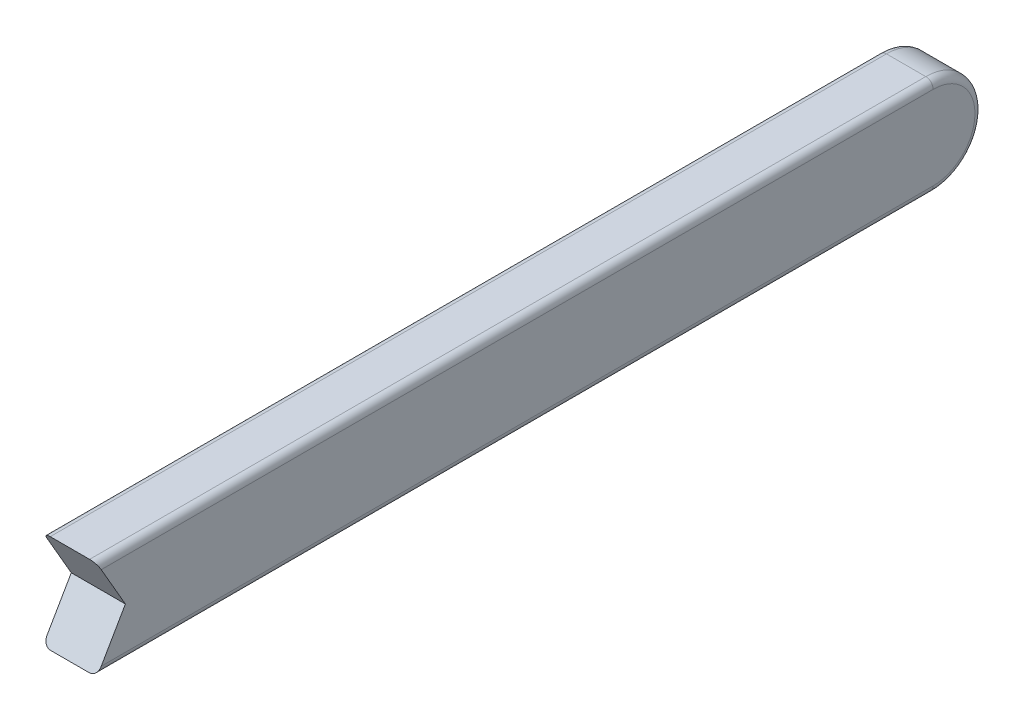
ISO-10303-21;
HEADER;
FILE_DESCRIPTION(('STEP AP214'),'2;1');
FILE_NAME('part.step','',(''),(''),'','','');
FILE_SCHEMA(('AUTOMOTIVE_DESIGN { 1 0 10303 214 1 1 1 1 }'));
ENDSEC;
DATA;
#1=APPLICATION_CONTEXT('core data for automotive mechanical design processes');
#2=APPLICATION_PROTOCOL_DEFINITION('international standard','automotive_design',2000,#1);
#3=PRODUCT_CONTEXT('',#1,'mechanical');
#4=PRODUCT('Part','Part','',(#3));
#5=PRODUCT_RELATED_PRODUCT_CATEGORY('part','',(#4));
#6=PRODUCT_DEFINITION_FORMATION('','',#4);
#7=PRODUCT_DEFINITION_CONTEXT('part definition',#1,'design');
#8=PRODUCT_DEFINITION('design','',#6,#7);
#9=PRODUCT_DEFINITION_SHAPE('','',#8);
#10=(LENGTH_UNIT() NAMED_UNIT(*) SI_UNIT(.MILLI.,.METRE.));
#11=(NAMED_UNIT(*) PLANE_ANGLE_UNIT() SI_UNIT($,.RADIAN.));
#12=(NAMED_UNIT(*) SI_UNIT($,.STERADIAN.) SOLID_ANGLE_UNIT());
#13=UNCERTAINTY_MEASURE_WITH_UNIT(LENGTH_MEASURE(1.E-05),#10,'distance_accuracy_value','');
#14=(GEOMETRIC_REPRESENTATION_CONTEXT(3) GLOBAL_UNCERTAINTY_ASSIGNED_CONTEXT((#13)) GLOBAL_UNIT_ASSIGNED_CONTEXT((#10,
#11,#12)) REPRESENTATION_CONTEXT('',''));
#15=CARTESIAN_POINT('',(0.,0.,0.));
#16=DIRECTION('',(0.,0.,1.));
#17=DIRECTION('',(1.,0.,0.));
#18=AXIS2_PLACEMENT_3D('',#15,#16,#17);
#19=CARTESIAN_POINT('',(5.5,0.,-87.8867513459482));
#20=DIRECTION('',(-1.,0.,0.));
#21=DIRECTION('',(0.,0.,1.));
#22=AXIS2_PLACEMENT_3D('',#19,#20,#21);
#23=CYLINDRICAL_SURFACE('',#22,4.99999999999998);
#24=DIRECTION('',(-1.,0.,0.));
#25=VECTOR('',#24,1.);
#26=CARTESIAN_POINT('',(5.5,-4.99999999999999,-87.8867513459482));
#27=LINE('',#26,#25);
#28=CARTESIAN_POINT('',(0.75,-4.99999999999999,-87.8867513459482));
#29=VERTEX_POINT('',#28);
#30=CARTESIAN_POINT('',(4.75,-4.99999999999999,-87.8867513459482));
#31=VERTEX_POINT('',#30);
#32=EDGE_CURVE('E143',#29,#31,#27,.F.);
#33=ORIENTED_EDGE('',*,*,#32,.F.);
#34=CARTESIAN_POINT('',(0.75,0.,-87.8867513459482));
#35=DIRECTION('',(1.,0.,0.));
#36=DIRECTION('',(0.,0.,-1.));
#37=AXIS2_PLACEMENT_3D('',#34,#35,#36);
#38=CIRCLE('',#37,4.99999999999998);
#39=CARTESIAN_POINT('',(0.75,5.,-87.8867513459482));
#40=VERTEX_POINT('',#39);
#41=EDGE_CURVE('E155',#29,#40,#38,.T.);
#42=ORIENTED_EDGE('',*,*,#41,.T.);
#43=DIRECTION('',(-1.,0.,0.));
#44=VECTOR('',#43,1.);
#45=CARTESIAN_POINT('',(5.5,5.,-87.8867513459482));
#46=LINE('',#45,#44);
#47=CARTESIAN_POINT('',(4.75,5.,-87.8867513459482));
#48=VERTEX_POINT('',#47);
#49=EDGE_CURVE('E141',#48,#40,#46,.T.);
#50=ORIENTED_EDGE('',*,*,#49,.F.);
#51=CARTESIAN_POINT('',(4.75,0.,-87.8867513459482));
#52=DIRECTION('',(1.,0.,0.));
#53=DIRECTION('',(0.,0.,-1.));
#54=AXIS2_PLACEMENT_3D('',#51,#52,#53);
#55=CIRCLE('',#54,4.99999999999998);
#56=EDGE_CURVE('E153',#48,#31,#55,.F.);
#57=ORIENTED_EDGE('',*,*,#56,.T.);
#58=EDGE_LOOP('',(#33,#42,#50,#57));
#59=FACE_BOUND('',#58,.T.);
#60=ADVANCED_FACE('F35',(#59),#23,.T.);
#61=CARTESIAN_POINT('',(5.5,-4.99999999999995,0.));
#62=DIRECTION('',(0.,-1.,0.));
#63=DIRECTION('',(0.,0.,-1.));
#64=AXIS2_PLACEMENT_3D('',#61,#62,#63);
#65=PLANE('',#64);
#66=DIRECTION('',(-1.,0.,0.));
#67=VECTOR('',#66,1.);
#68=CARTESIAN_POINT('',(5.5,-4.99999999999995,-2.88675134594818));
#69=LINE('',#68,#67);
#70=CARTESIAN_POINT('',(4.75,-4.99999999999995,-2.88675134594818));
#71=VERTEX_POINT('',#70);
#72=CARTESIAN_POINT('',(0.75,-4.99999999999995,-2.88675134594818));
#73=VERTEX_POINT('',#72);
#74=EDGE_CURVE('E120',#71,#73,#69,.T.);
#75=ORIENTED_EDGE('',*,*,#74,.T.);
#76=DIRECTION('',(0.,0.,1.));
#77=VECTOR('',#76,1.);
#78=CARTESIAN_POINT('',(0.75,-4.99999999999999,-87.8867513459481));
#79=LINE('',#78,#77);
#80=EDGE_CURVE('E167',#73,#29,#79,.F.);
#81=ORIENTED_EDGE('',*,*,#80,.T.);
#82=ORIENTED_EDGE('',*,*,#32,.T.);
#83=DIRECTION('',(0.,0.,1.));
#84=VECTOR('',#83,1.);
#85=CARTESIAN_POINT('',(4.75,-4.99999999999995,0.));
#86=LINE('',#85,#84);
#87=EDGE_CURVE('E165',#31,#71,#86,.T.);
#88=ORIENTED_EDGE('',*,*,#87,.T.);
#89=EDGE_LOOP('',(#75,#81,#82,#88));
#90=FACE_BOUND('',#89,.T.);
#91=ADVANCED_FACE('F187',(#90),#65,.T.);
#92=CARTESIAN_POINT('',(5.5,4.99999999999999,0.));
#93=DIRECTION('',(0.,1.,0.));
#94=DIRECTION('',(0.,0.,1.));
#95=AXIS2_PLACEMENT_3D('',#92,#93,#94);
#96=PLANE('',#95);
#97=ORIENTED_EDGE('',*,*,#49,.T.);
#98=DIRECTION('',(0.,0.,-1.));
#99=VECTOR('',#98,1.);
#100=CARTESIAN_POINT('',(0.75,4.99999999999999,-2.88675134594811));
#101=LINE('',#100,#99);
#102=CARTESIAN_POINT('',(0.75,4.99999999999999,-2.88675134594811));
#103=VERTEX_POINT('',#102);
#104=EDGE_CURVE('E52',#40,#103,#101,.F.);
#105=ORIENTED_EDGE('',*,*,#104,.T.);
#106=DIRECTION('',(-1.,0.,0.));
#107=VECTOR('',#106,1.);
#108=CARTESIAN_POINT('',(5.5,4.99999999999999,-2.88675134594811));
#109=LINE('',#108,#107);
#110=CARTESIAN_POINT('',(4.75,4.99999999999999,-2.88675134594811));
#111=VERTEX_POINT('',#110);
#112=EDGE_CURVE('E126',#111,#103,#109,.T.);
#113=ORIENTED_EDGE('',*,*,#112,.F.);
#114=DIRECTION('',(0.,0.,-1.));
#115=VECTOR('',#114,1.);
#116=CARTESIAN_POINT('',(4.75,4.99999999999999,0.));
#117=LINE('',#116,#115);
#118=EDGE_CURVE('E169',#111,#48,#117,.T.);
#119=ORIENTED_EDGE('',*,*,#118,.T.);
#120=EDGE_LOOP('',(#97,#105,#113,#119));
#121=FACE_BOUND('',#120,.T.);
#122=ADVANCED_FACE('F222',(#121),#96,.T.);
#123=CARTESIAN_POINT('',(5.5,2.5,-4.33012701892217));
#124=DIRECTION('',(0.,-0.500000000000001,0.866025403784438));
#125=DIRECTION('',(0.,-0.866025403784438,-0.500000000000001));
#126=AXIS2_PLACEMENT_3D('',#123,#124,#125);
#127=PLANE('',#126);
#128=ORIENTED_EDGE('',*,*,#112,.T.);
#129=CARTESIAN_POINT('',(0.75,4.24999999999999,-3.31976404784033));
#130=DIRECTION('',(0.,-0.500000000000001,0.866025403784438));
#131=DIRECTION('',(0.,0.866025403784438,0.500000000000001));
#132=AXIS2_PLACEMENT_3D('',#129,#130,#131);
#133=ELLIPSE('',#132,0.866025403784439,0.75);
#134=CARTESIAN_POINT('',(0.,4.24999999999999,-3.31976404784033));
#135=VERTEX_POINT('',#134);
#136=EDGE_CURVE('E11',#103,#135,#133,.T.);
#137=ORIENTED_EDGE('',*,*,#136,.T.);
#138=DIRECTION('',(0.,0.866025403784438,0.500000000000001));
#139=VECTOR('',#138,1.);
#140=CARTESIAN_POINT('',(0.,2.5,-4.33012701892217));
#141=LINE('',#140,#139);
#142=CARTESIAN_POINT('',(0.,0.,-5.77350269189624));
#143=VERTEX_POINT('',#142);
#144=EDGE_CURVE('E125',#143,#135,#141,.T.);
#145=ORIENTED_EDGE('',*,*,#144,.F.);
#146=DIRECTION('',(-1.,0.,0.));
#147=VECTOR('',#146,1.);
#148=CARTESIAN_POINT('',(5.5,0.,-5.77350269189624));
#149=LINE('',#148,#147);
#150=CARTESIAN_POINT('',(5.5,0.,-5.77350269189624));
#151=VERTEX_POINT('',#150);
#152=EDGE_CURVE('E112',#151,#143,#149,.T.);
#153=ORIENTED_EDGE('',*,*,#152,.F.);
#154=DIRECTION('',(0.,0.866025403784438,0.500000000000001));
#155=VECTOR('',#154,1.);
#156=CARTESIAN_POINT('',(5.5,2.5,-4.33012701892217));
#157=LINE('',#156,#155);
#158=CARTESIAN_POINT('',(5.5,4.24999999999999,-3.31976404784033));
#159=VERTEX_POINT('',#158);
#160=EDGE_CURVE('E121',#151,#159,#157,.T.);
#161=ORIENTED_EDGE('',*,*,#160,.T.);
#162=CARTESIAN_POINT('',(4.75,4.24999999999999,-3.31976404784033));
#163=DIRECTION('',(0.,-0.500000000000001,0.866025403784438));
#164=DIRECTION('',(0.,-0.866025403784438,-0.500000000000001));
#165=AXIS2_PLACEMENT_3D('',#162,#163,#164);
#166=ELLIPSE('',#165,0.866025403784439,0.75);
#167=EDGE_CURVE('E44',#159,#111,#166,.T.);
#168=ORIENTED_EDGE('',*,*,#167,.T.);
#169=EDGE_LOOP('',(#128,#137,#145,#153,#161,#168));
#170=FACE_BOUND('',#169,.T.);
#171=ADVANCED_FACE('F123',(#170),#127,.T.);
#172=CARTESIAN_POINT('',(5.5,-2.49999999999998,-4.33012701892221));
#173=DIRECTION('',(0.,0.499999999999995,0.866025403784442));
#174=DIRECTION('',(0.,-0.866025403784441,0.499999999999995));
#175=AXIS2_PLACEMENT_3D('',#172,#173,#174);
#176=PLANE('',#175);
#177=DIRECTION('',(0.,0.866025403784442,-0.499999999999995));
#178=VECTOR('',#177,1.);
#179=CARTESIAN_POINT('',(0.,-2.49999999999998,-4.33012701892221));
#180=LINE('',#179,#178);
#181=CARTESIAN_POINT('',(0.,-4.24999999999995,-3.31976404784039));
#182=VERTEX_POINT('',#181);
#183=EDGE_CURVE('E132',#182,#143,#180,.T.);
#184=ORIENTED_EDGE('',*,*,#183,.F.);
#185=CARTESIAN_POINT('',(0.75,-4.24999999999995,-3.31976404784039));
#186=DIRECTION('',(0.,0.499999999999995,0.866025403784442));
#187=DIRECTION('',(0.,0.866025403784441,-0.499999999999995));
#188=AXIS2_PLACEMENT_3D('',#185,#186,#187);
#189=ELLIPSE('',#188,0.866025403784435,0.75);
#190=EDGE_CURVE('E163',#182,#73,#189,.T.);
#191=ORIENTED_EDGE('',*,*,#190,.T.);
#192=ORIENTED_EDGE('',*,*,#74,.F.);
#193=CARTESIAN_POINT('',(4.75,-4.24999999999995,-3.31976404784039));
#194=DIRECTION('',(0.,0.499999999999995,0.866025403784442));
#195=DIRECTION('',(0.,-0.866025403784441,0.499999999999995));
#196=AXIS2_PLACEMENT_3D('',#193,#194,#195);
#197=ELLIPSE('',#196,0.866025403784435,0.75);
#198=CARTESIAN_POINT('',(5.5,-4.24999999999995,-3.31976404784039));
#199=VERTEX_POINT('',#198);
#200=EDGE_CURVE('E116',#71,#199,#197,.T.);
#201=ORIENTED_EDGE('',*,*,#200,.T.);
#202=DIRECTION('',(0.,0.866025403784442,-0.499999999999995));
#203=VECTOR('',#202,1.);
#204=CARTESIAN_POINT('',(5.5,-2.49999999999998,-4.33012701892221));
#205=LINE('',#204,#203);
#206=EDGE_CURVE('E108',#199,#151,#205,.T.);
#207=ORIENTED_EDGE('',*,*,#206,.T.);
#208=ORIENTED_EDGE('',*,*,#152,.T.);
#209=EDGE_LOOP('',(#184,#191,#192,#201,#207,#208));
#210=FACE_BOUND('',#209,.T.);
#211=ADVANCED_FACE('F111',(#210),#176,.T.);
#212=CARTESIAN_POINT('',(5.5,0.,0.));
#213=DIRECTION('',(1.,0.,0.));
#214=DIRECTION('',(0.,0.,-1.));
#215=AXIS2_PLACEMENT_3D('',#212,#213,#214);
#216=PLANE('',#215);
#217=ORIENTED_EDGE('',*,*,#206,.F.);
#218=DIRECTION('',(0.,0.,1.));
#219=VECTOR('',#218,1.);
#220=CARTESIAN_POINT('',(5.5,-4.24999999999995,0.));
#221=LINE('',#220,#219);
#222=CARTESIAN_POINT('',(5.5,-4.24999999999998,-87.8867513459482));
#223=VERTEX_POINT('',#222);
#224=EDGE_CURVE('E160',#199,#223,#221,.F.);
#225=ORIENTED_EDGE('',*,*,#224,.T.);
#226=CARTESIAN_POINT('',(5.5,0.,-87.8867513459482));
#227=DIRECTION('',(1.,0.,0.));
#228=DIRECTION('',(0.,0.,-1.));
#229=AXIS2_PLACEMENT_3D('',#226,#227,#228);
#230=CIRCLE('',#229,4.24999999999998);
#231=CARTESIAN_POINT('',(5.5,4.25,-87.8867513459482));
#232=VERTEX_POINT('',#231);
#233=EDGE_CURVE('E158',#223,#232,#230,.T.);
#234=ORIENTED_EDGE('',*,*,#233,.T.);
#235=DIRECTION('',(0.,0.,-1.));
#236=VECTOR('',#235,1.);
#237=CARTESIAN_POINT('',(5.5,4.24999999999999,0.));
#238=LINE('',#237,#236);
#239=EDGE_CURVE('E131',#232,#159,#238,.F.);
#240=ORIENTED_EDGE('',*,*,#239,.T.);
#241=ORIENTED_EDGE('',*,*,#160,.F.);
#242=EDGE_LOOP('',(#217,#225,#234,#240,#241));
#243=FACE_BOUND('',#242,.T.);
#244=ADVANCED_FACE('F128',(#243),#216,.T.);
#245=CARTESIAN_POINT('',(0.,0.,0.));
#246=DIRECTION('',(1.,0.,0.));
#247=DIRECTION('',(0.,0.,-1.));
#248=AXIS2_PLACEMENT_3D('',#245,#246,#247);
#249=PLANE('',#248);
#250=CARTESIAN_POINT('',(0.,0.,-87.8867513459482));
#251=DIRECTION('',(1.,0.,0.));
#252=DIRECTION('',(0.,0.,-1.));
#253=AXIS2_PLACEMENT_3D('',#250,#251,#252);
#254=CIRCLE('',#253,4.24999999999998);
#255=CARTESIAN_POINT('',(0.,4.25,-87.8867513459482));
#256=VERTEX_POINT('',#255);
#257=CARTESIAN_POINT('',(0.,-4.24999999999998,-87.8867513459482));
#258=VERTEX_POINT('',#257);
#259=EDGE_CURVE('E148',#256,#258,#254,.F.);
#260=ORIENTED_EDGE('',*,*,#259,.T.);
#261=DIRECTION('',(0.,0.,1.));
#262=VECTOR('',#261,1.);
#263=CARTESIAN_POINT('',(0.,-4.24999999999995,-2.88675134594818));
#264=LINE('',#263,#262);
#265=EDGE_CURVE('E151',#258,#182,#264,.T.);
#266=ORIENTED_EDGE('',*,*,#265,.T.);
#267=ORIENTED_EDGE('',*,*,#183,.T.);
#268=ORIENTED_EDGE('',*,*,#144,.T.);
#269=DIRECTION('',(0.,0.,-1.));
#270=VECTOR('',#269,1.);
#271=CARTESIAN_POINT('',(0.,4.25,-87.8867513459482));
#272=LINE('',#271,#270);
#273=EDGE_CURVE('E146',#135,#256,#272,.T.);
#274=ORIENTED_EDGE('',*,*,#273,.T.);
#275=EDGE_LOOP('',(#260,#266,#267,#268,#274));
#276=FACE_BOUND('',#275,.T.);
#277=ADVANCED_FACE('F207',(#276),#249,.F.);
#278=CARTESIAN_POINT('',(0.75,4.24999999999999,0.));
#279=DIRECTION('',(0.,0.,1.));
#280=DIRECTION('',(0.,-1.,0.));
#281=AXIS2_PLACEMENT_3D('',#278,#279,#280);
#282=CYLINDRICAL_SURFACE('',#281,0.75);
#283=ORIENTED_EDGE('',*,*,#136,.F.);
#284=ORIENTED_EDGE('',*,*,#104,.F.);
#285=CARTESIAN_POINT('',(0.75,4.25,-87.8867513459482));
#286=DIRECTION('',(0.,0.,-1.));
#287=DIRECTION('',(-1.,0.,0.));
#288=AXIS2_PLACEMENT_3D('',#285,#286,#287);
#289=CIRCLE('',#288,0.75);
#290=EDGE_CURVE('E136',#256,#40,#289,.T.);
#291=ORIENTED_EDGE('',*,*,#290,.F.);
#292=ORIENTED_EDGE('',*,*,#273,.F.);
#293=EDGE_LOOP('',(#283,#284,#291,#292));
#294=FACE_BOUND('',#293,.T.);
#295=ADVANCED_FACE('F205',(#294),#282,.T.);
#296=CARTESIAN_POINT('',(0.75,-4.24999999999995,0.));
#297=DIRECTION('',(0.,0.,-1.));
#298=DIRECTION('',(0.,1.,0.));
#299=AXIS2_PLACEMENT_3D('',#296,#297,#298);
#300=CYLINDRICAL_SURFACE('',#299,0.75);
#301=ORIENTED_EDGE('',*,*,#190,.F.);
#302=ORIENTED_EDGE('',*,*,#265,.F.);
#303=CARTESIAN_POINT('',(0.75,-4.24999999999999,-87.8867513459482));
#304=DIRECTION('',(0.,0.,-1.));
#305=DIRECTION('',(-1.,0.,0.));
#306=AXIS2_PLACEMENT_3D('',#303,#304,#305);
#307=CIRCLE('',#306,0.75);
#308=EDGE_CURVE('E173',#29,#258,#307,.T.);
#309=ORIENTED_EDGE('',*,*,#308,.F.);
#310=ORIENTED_EDGE('',*,*,#80,.F.);
#311=EDGE_LOOP('',(#301,#302,#309,#310));
#312=FACE_BOUND('',#311,.T.);
#313=ADVANCED_FACE('F193',(#312),#300,.T.);
#314=CARTESIAN_POINT('',(0.75,0.,-87.8867513459482));
#315=DIRECTION('',(1.,0.,0.));
#316=DIRECTION('',(0.,0.,-1.));
#317=AXIS2_PLACEMENT_3D('',#314,#315,#316);
#318=TOROIDAL_SURFACE('',#317,4.24999999999998,0.75);
#319=ORIENTED_EDGE('',*,*,#290,.T.);
#320=ORIENTED_EDGE('',*,*,#41,.F.);
#321=ORIENTED_EDGE('',*,*,#308,.T.);
#322=ORIENTED_EDGE('',*,*,#259,.F.);
#323=EDGE_LOOP('',(#319,#320,#321,#322));
#324=FACE_BOUND('',#323,.T.);
#325=ADVANCED_FACE('F199',(#324),#318,.T.);
#326=CARTESIAN_POINT('',(4.75,-4.24999999999995,0.));
#327=DIRECTION('',(0.,0.,1.));
#328=DIRECTION('',(0.,-1.,0.));
#329=AXIS2_PLACEMENT_3D('',#326,#327,#328);
#330=CYLINDRICAL_SURFACE('',#329,0.75);
#331=ORIENTED_EDGE('',*,*,#200,.F.);
#332=ORIENTED_EDGE('',*,*,#87,.F.);
#333=CARTESIAN_POINT('',(4.75,-4.24999999999999,-87.8867513459482));
#334=DIRECTION('',(0.,0.,-1.));
#335=DIRECTION('',(-1.,0.,0.));
#336=AXIS2_PLACEMENT_3D('',#333,#334,#335);
#337=CIRCLE('',#336,0.75);
#338=EDGE_CURVE('E39',#223,#31,#337,.T.);
#339=ORIENTED_EDGE('',*,*,#338,.F.);
#340=ORIENTED_EDGE('',*,*,#224,.F.);
#341=EDGE_LOOP('',(#331,#332,#339,#340));
#342=FACE_BOUND('',#341,.T.);
#343=ADVANCED_FACE('F37',(#342),#330,.T.);
#344=CARTESIAN_POINT('',(4.75,4.24999999999999,0.));
#345=DIRECTION('',(0.,0.,-1.));
#346=DIRECTION('',(0.,1.,0.));
#347=AXIS2_PLACEMENT_3D('',#344,#345,#346);
#348=CYLINDRICAL_SURFACE('',#347,0.75);
#349=ORIENTED_EDGE('',*,*,#167,.F.);
#350=ORIENTED_EDGE('',*,*,#239,.F.);
#351=CARTESIAN_POINT('',(4.75,4.25,-87.8867513459482));
#352=DIRECTION('',(0.,0.,-1.));
#353=DIRECTION('',(-1.,0.,0.));
#354=AXIS2_PLACEMENT_3D('',#351,#352,#353);
#355=CIRCLE('',#354,0.75);
#356=EDGE_CURVE('E176',#48,#232,#355,.T.);
#357=ORIENTED_EDGE('',*,*,#356,.F.);
#358=ORIENTED_EDGE('',*,*,#118,.F.);
#359=EDGE_LOOP('',(#349,#350,#357,#358));
#360=FACE_BOUND('',#359,.T.);
#361=ADVANCED_FACE('F234',(#360),#348,.T.);
#362=CARTESIAN_POINT('',(4.75,0.,-87.8867513459482));
#363=DIRECTION('',(1.,0.,0.));
#364=DIRECTION('',(0.,0.,-1.));
#365=AXIS2_PLACEMENT_3D('',#362,#363,#364);
#366=TOROIDAL_SURFACE('',#365,4.24999999999998,0.75);
#367=ORIENTED_EDGE('',*,*,#338,.T.);
#368=ORIENTED_EDGE('',*,*,#56,.F.);
#369=ORIENTED_EDGE('',*,*,#356,.T.);
#370=ORIENTED_EDGE('',*,*,#233,.F.);
#371=EDGE_LOOP('',(#367,#368,#369,#370));
#372=FACE_BOUND('',#371,.T.);
#373=ADVANCED_FACE('F183',(#372),#366,.T.);
#374=CLOSED_SHELL('',(#60,#91,#122,#171,#211,#244,#277,#295,#313,#325,#343,#361,#373));
#375=MANIFOLD_SOLID_BREP('B2',#374);
#376=ADVANCED_BREP_SHAPE_REPRESENTATION('',(#18,#375),#14);
#377=SHAPE_DEFINITION_REPRESENTATION(#9,#376);
ENDSEC;
END-ISO-10303-21;
